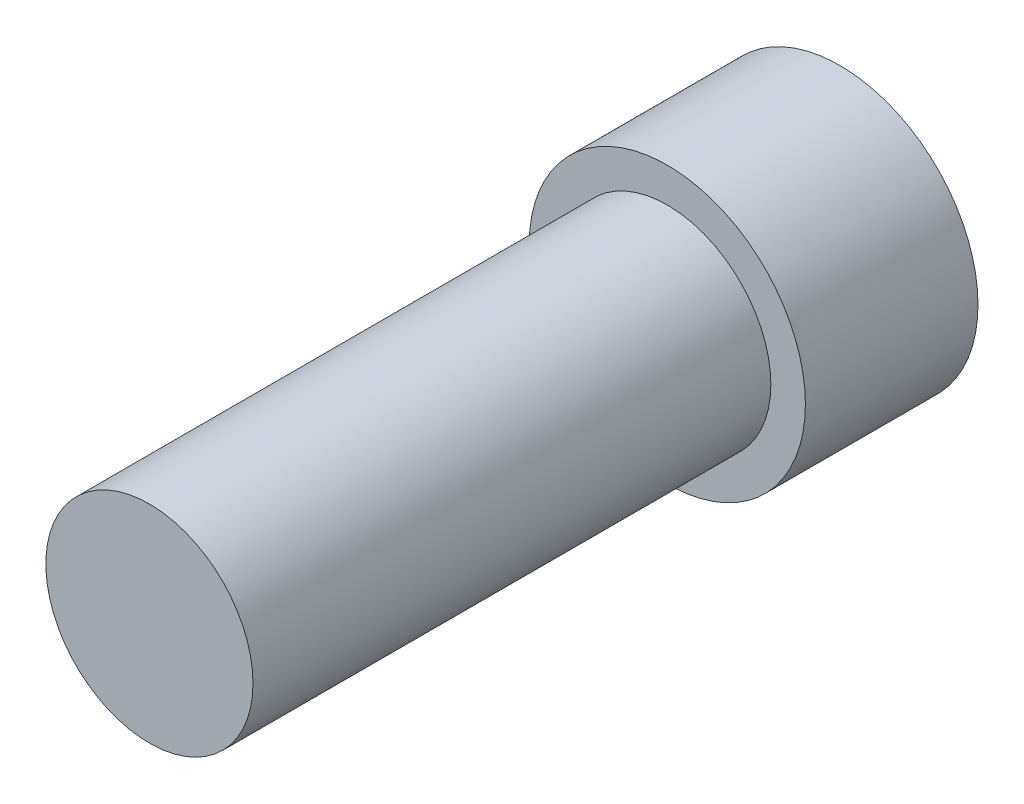
ISO-10303-21;
HEADER;
FILE_DESCRIPTION(('STEP AP214'),'2;1');
FILE_NAME('part.step','',(''),(''),'','','');
FILE_SCHEMA(('AUTOMOTIVE_DESIGN { 1 0 10303 214 1 1 1 1 }'));
ENDSEC;
DATA;
#1=APPLICATION_CONTEXT('core data for automotive mechanical design processes');
#2=APPLICATION_PROTOCOL_DEFINITION('international standard','automotive_design',2000,#1);
#3=PRODUCT_CONTEXT('',#1,'mechanical');
#4=PRODUCT('Part','Part','',(#3));
#5=PRODUCT_RELATED_PRODUCT_CATEGORY('part','',(#4));
#6=PRODUCT_DEFINITION_FORMATION('','',#4);
#7=PRODUCT_DEFINITION_CONTEXT('part definition',#1,'design');
#8=PRODUCT_DEFINITION('design','',#6,#7);
#9=PRODUCT_DEFINITION_SHAPE('','',#8);
#10=(LENGTH_UNIT() NAMED_UNIT(*) SI_UNIT(.MILLI.,.METRE.));
#11=(NAMED_UNIT(*) PLANE_ANGLE_UNIT() SI_UNIT($,.RADIAN.));
#12=(NAMED_UNIT(*) SI_UNIT($,.STERADIAN.) SOLID_ANGLE_UNIT());
#13=UNCERTAINTY_MEASURE_WITH_UNIT(LENGTH_MEASURE(1.E-05),#10,'distance_accuracy_value','');
#14=(GEOMETRIC_REPRESENTATION_CONTEXT(3) GLOBAL_UNCERTAINTY_ASSIGNED_CONTEXT((#13)) GLOBAL_UNIT_ASSIGNED_CONTEXT((#10,
#11,#12)) REPRESENTATION_CONTEXT('',''));
#15=CARTESIAN_POINT('',(0.,0.,0.));
#16=DIRECTION('',(0.,0.,1.));
#17=DIRECTION('',(1.,0.,0.));
#18=AXIS2_PLACEMENT_3D('',#15,#16,#17);
#19=CARTESIAN_POINT('',(0.,0.,5.));
#20=DIRECTION('',(0.,0.,-1.));
#21=DIRECTION('',(-1.,0.,0.));
#22=AXIS2_PLACEMENT_3D('',#19,#20,#21);
#23=CYLINDRICAL_SURFACE('',#22,4.);
#24=CARTESIAN_POINT('',(0.,0.,5.));
#25=DIRECTION('',(0.,0.,1.));
#26=DIRECTION('',(1.,0.,0.));
#27=AXIS2_PLACEMENT_3D('',#24,#25,#26);
#28=CIRCLE('',#27,4.);
#29=CARTESIAN_POINT('',(4.,0.,5.));
#30=VERTEX_POINT('',#29);
#31=EDGE_CURVE('E49',#30,#30,#28,.T.);
#32=ORIENTED_EDGE('',*,*,#31,.F.);
#33=EDGE_LOOP('',(#32));
#34=FACE_BOUND('',#33,.T.);
#35=CARTESIAN_POINT('',(0.,0.,0.));
#36=DIRECTION('',(0.,0.,1.));
#37=DIRECTION('',(1.,0.,0.));
#38=AXIS2_PLACEMENT_3D('',#35,#36,#37);
#39=CIRCLE('',#38,4.);
#40=CARTESIAN_POINT('',(4.,0.,0.));
#41=VERTEX_POINT('',#40);
#42=EDGE_CURVE('E43',#41,#41,#39,.T.);
#43=ORIENTED_EDGE('',*,*,#42,.T.);
#44=EDGE_LOOP('',(#43));
#45=FACE_BOUND('',#44,.T.);
#46=ADVANCED_FACE('F40',(#34,#45),#23,.T.);
#47=CARTESIAN_POINT('',(0.,0.,5.));
#48=DIRECTION('',(0.,0.,1.));
#49=DIRECTION('',(1.,0.,0.));
#50=AXIS2_PLACEMENT_3D('',#47,#48,#49);
#51=PLANE('',#50);
#52=CARTESIAN_POINT('',(0.,0.,5.));
#53=DIRECTION('',(0.,0.,1.));
#54=DIRECTION('',(1.,0.,0.));
#55=AXIS2_PLACEMENT_3D('',#52,#53,#54);
#56=CIRCLE('',#55,3.);
#57=CARTESIAN_POINT('',(3.,0.,5.));
#58=VERTEX_POINT('',#57);
#59=EDGE_CURVE('E11',#58,#58,#56,.T.);
#60=ORIENTED_EDGE('',*,*,#59,.F.);
#61=EDGE_LOOP('',(#60));
#62=FACE_BOUND('',#61,.T.);
#63=ORIENTED_EDGE('',*,*,#31,.T.);
#64=EDGE_LOOP('',(#63));
#65=FACE_BOUND('',#64,.T.);
#66=ADVANCED_FACE('F180',(#62,#65),#51,.T.);
#67=CARTESIAN_POINT('',(0.,0.,0.));
#68=DIRECTION('',(0.,0.,1.));
#69=DIRECTION('',(1.,0.,0.));
#70=AXIS2_PLACEMENT_3D('',#67,#68,#69);
#71=PLANE('',#70);
#72=DIRECTION('',(-0.808522392035072,0.58846541238877,0.));
#73=VECTOR('',#72,1.);
#74=CARTESIAN_POINT('',(-0.294791557784919,-2.78224454496012,0.));
#75=LINE('',#74,#73);
#76=CARTESIAN_POINT('',(-0.294791557784919,-2.78224454496012,0.));
#77=VERTEX_POINT('',#76);
#78=CARTESIAN_POINT('',(-2.5568902343686,-1.13582529461713,0.));
#79=VERTEX_POINT('',#78);
#80=EDGE_CURVE('E138',#77,#79,#75,.T.);
#81=ORIENTED_EDGE('',*,*,#80,.F.);
#82=DIRECTION('',(-0.913887192394696,-0.405968224836549,0.));
#83=VECTOR('',#82,1.);
#84=CARTESIAN_POINT('',(2.26209867658368,-1.64641925034299,0.));
#85=LINE('',#84,#83);
#86=CARTESIAN_POINT('',(2.26209867658368,-1.64641925034299,0.));
#87=VERTEX_POINT('',#86);
#88=EDGE_CURVE('E57',#87,#77,#85,.T.);
#89=ORIENTED_EDGE('',*,*,#88,.F.);
#90=DIRECTION('',(-0.105364800359624,-0.994433637225319,0.));
#91=VECTOR('',#90,1.);
#92=CARTESIAN_POINT('',(2.5568902343686,1.13582529461713,0.));
#93=LINE('',#92,#91);
#94=CARTESIAN_POINT('',(2.5568902343686,1.13582529461713,0.));
#95=VERTEX_POINT('',#94);
#96=EDGE_CURVE('E151',#95,#87,#93,.T.);
#97=ORIENTED_EDGE('',*,*,#96,.F.);
#98=DIRECTION('',(0.808522392035073,-0.588465412388769,0.));
#99=VECTOR('',#98,1.);
#100=CARTESIAN_POINT('',(0.29479155778492,2.78224454496012,0.));
#101=LINE('',#100,#99);
#102=CARTESIAN_POINT('',(0.29479155778492,2.78224454496012,0.));
#103=VERTEX_POINT('',#102);
#104=EDGE_CURVE('E148',#103,#95,#101,.T.);
#105=ORIENTED_EDGE('',*,*,#104,.F.);
#106=DIRECTION('',(0.913887192394696,0.405968224836549,0.));
#107=VECTOR('',#106,1.);
#108=CARTESIAN_POINT('',(-2.26209867658368,1.64641925034299,0.));
#109=LINE('',#108,#107);
#110=CARTESIAN_POINT('',(-2.26209867658368,1.64641925034299,0.));
#111=VERTEX_POINT('',#110);
#112=EDGE_CURVE('E105',#111,#103,#109,.T.);
#113=ORIENTED_EDGE('',*,*,#112,.F.);
#114=DIRECTION('',(0.105364800359624,0.994433637225319,0.));
#115=VECTOR('',#114,1.);
#116=CARTESIAN_POINT('',(-2.5568902343686,-1.13582529461713,0.));
#117=LINE('',#116,#115);
#118=EDGE_CURVE('E142',#79,#111,#117,.T.);
#119=ORIENTED_EDGE('',*,*,#118,.F.);
#120=EDGE_LOOP('',(#81,#89,#97,#105,#113,#119));
#121=FACE_BOUND('',#120,.T.);
#122=ORIENTED_EDGE('',*,*,#42,.F.);
#123=EDGE_LOOP('',(#122));
#124=FACE_BOUND('',#123,.T.);
#125=ADVANCED_FACE('F177',(#121,#124),#71,.F.);
#126=CARTESIAN_POINT('',(0.,0.,20.));
#127=DIRECTION('',(0.,0.,-1.));
#128=DIRECTION('',(-1.,0.,0.));
#129=AXIS2_PLACEMENT_3D('',#126,#127,#128);
#130=CYLINDRICAL_SURFACE('',#129,3.);
#131=CARTESIAN_POINT('',(0.,0.,20.));
#132=DIRECTION('',(0.,0.,1.));
#133=DIRECTION('',(1.,0.,0.));
#134=AXIS2_PLACEMENT_3D('',#131,#132,#133);
#135=CIRCLE('',#134,3.);
#136=CARTESIAN_POINT('',(3.,0.,20.));
#137=VERTEX_POINT('',#136);
#138=EDGE_CURVE('E156',#137,#137,#135,.T.);
#139=ORIENTED_EDGE('',*,*,#138,.F.);
#140=EDGE_LOOP('',(#139));
#141=FACE_BOUND('',#140,.T.);
#142=ORIENTED_EDGE('',*,*,#59,.T.);
#143=EDGE_LOOP('',(#142));
#144=FACE_BOUND('',#143,.T.);
#145=ADVANCED_FACE('F179',(#141,#144),#130,.T.);
#146=CARTESIAN_POINT('',(0.,0.,20.));
#147=DIRECTION('',(0.,0.,1.));
#148=DIRECTION('',(1.,0.,0.));
#149=AXIS2_PLACEMENT_3D('',#146,#147,#148);
#150=PLANE('',#149);
#151=ORIENTED_EDGE('',*,*,#138,.T.);
#152=EDGE_LOOP('',(#151));
#153=FACE_BOUND('',#152,.T.);
#154=ADVANCED_FACE('F186',(#153),#150,.T.);
#155=CARTESIAN_POINT('',(2.26209867658368,-1.64641925034299,3.));
#156=DIRECTION('',(0.405968224836549,-0.913887192394696,0.));
#157=DIRECTION('',(0.913887192394697,0.405968224836549,0.));
#158=AXIS2_PLACEMENT_3D('',#155,#156,#157);
#159=PLANE('',#158);
#160=ORIENTED_EDGE('',*,*,#88,.T.);
#161=DIRECTION('',(0.,0.,-1.));
#162=VECTOR('',#161,1.);
#163=CARTESIAN_POINT('',(-0.294791557784919,-2.78224454496012,3.));
#164=LINE('',#163,#162);
#165=CARTESIAN_POINT('',(-0.294791557784919,-2.78224454496012,3.));
#166=VERTEX_POINT('',#165);
#167=EDGE_CURVE('E87',#166,#77,#164,.T.);
#168=ORIENTED_EDGE('',*,*,#167,.F.);
#169=DIRECTION('',(-0.913887192394696,-0.405968224836549,0.));
#170=VECTOR('',#169,1.);
#171=CARTESIAN_POINT('',(2.26209867658368,-1.64641925034299,3.));
#172=LINE('',#171,#170);
#173=CARTESIAN_POINT('',(2.26209867658368,-1.64641925034299,3.));
#174=VERTEX_POINT('',#173);
#175=EDGE_CURVE('E154',#174,#166,#172,.T.);
#176=ORIENTED_EDGE('',*,*,#175,.F.);
#177=DIRECTION('',(0.,0.,-1.));
#178=VECTOR('',#177,1.);
#179=CARTESIAN_POINT('',(2.26209867658368,-1.64641925034299,3.));
#180=LINE('',#179,#178);
#181=EDGE_CURVE('E65',#174,#87,#180,.T.);
#182=ORIENTED_EDGE('',*,*,#181,.T.);
#183=EDGE_LOOP('',(#160,#168,#176,#182));
#184=FACE_BOUND('',#183,.T.);
#185=ADVANCED_FACE('F215',(#184),#159,.F.);
#186=CARTESIAN_POINT('',(2.5568902343686,1.13582529461713,3.));
#187=DIRECTION('',(0.994433637225319,-0.105364800359624,0.));
#188=DIRECTION('',(0.105364800359624,0.994433637225319,0.));
#189=AXIS2_PLACEMENT_3D('',#186,#187,#188);
#190=PLANE('',#189);
#191=ORIENTED_EDGE('',*,*,#96,.T.);
#192=ORIENTED_EDGE('',*,*,#181,.F.);
#193=DIRECTION('',(-0.105364800359624,-0.994433637225319,0.));
#194=VECTOR('',#193,1.);
#195=CARTESIAN_POINT('',(2.5568902343686,1.13582529461713,3.));
#196=LINE('',#195,#194);
#197=CARTESIAN_POINT('',(2.5568902343686,1.13582529461713,3.));
#198=VERTEX_POINT('',#197);
#199=EDGE_CURVE('E119',#198,#174,#196,.T.);
#200=ORIENTED_EDGE('',*,*,#199,.F.);
#201=DIRECTION('',(0.,0.,-1.));
#202=VECTOR('',#201,1.);
#203=CARTESIAN_POINT('',(2.5568902343686,1.13582529461713,3.));
#204=LINE('',#203,#202);
#205=EDGE_CURVE('E110',#198,#95,#204,.T.);
#206=ORIENTED_EDGE('',*,*,#205,.T.);
#207=EDGE_LOOP('',(#191,#192,#200,#206));
#208=FACE_BOUND('',#207,.T.);
#209=ADVANCED_FACE('F223',(#208),#190,.F.);
#210=CARTESIAN_POINT('',(0.29479155778492,2.78224454496012,3.));
#211=DIRECTION('',(0.588465412388769,0.808522392035073,0.));
#212=DIRECTION('',(-0.808522392035073,0.588465412388769,0.));
#213=AXIS2_PLACEMENT_3D('',#210,#211,#212);
#214=PLANE('',#213);
#215=ORIENTED_EDGE('',*,*,#104,.T.);
#216=ORIENTED_EDGE('',*,*,#205,.F.);
#217=DIRECTION('',(0.808522392035073,-0.588465412388769,0.));
#218=VECTOR('',#217,1.);
#219=CARTESIAN_POINT('',(0.29479155778492,2.78224454496012,3.));
#220=LINE('',#219,#218);
#221=CARTESIAN_POINT('',(0.29479155778492,2.78224454496012,3.));
#222=VERTEX_POINT('',#221);
#223=EDGE_CURVE('E114',#222,#198,#220,.T.);
#224=ORIENTED_EDGE('',*,*,#223,.F.);
#225=DIRECTION('',(0.,0.,-1.));
#226=VECTOR('',#225,1.);
#227=CARTESIAN_POINT('',(0.29479155778492,2.78224454496012,3.));
#228=LINE('',#227,#226);
#229=EDGE_CURVE('E98',#222,#103,#228,.T.);
#230=ORIENTED_EDGE('',*,*,#229,.T.);
#231=EDGE_LOOP('',(#215,#216,#224,#230));
#232=FACE_BOUND('',#231,.T.);
#233=ADVANCED_FACE('F115',(#232),#214,.F.);
#234=CARTESIAN_POINT('',(-2.26209867658368,1.64641925034299,3.));
#235=DIRECTION('',(-0.405968224836549,0.913887192394696,0.));
#236=DIRECTION('',(-0.913887192394697,-0.405968224836549,0.));
#237=AXIS2_PLACEMENT_3D('',#234,#235,#236);
#238=PLANE('',#237);
#239=ORIENTED_EDGE('',*,*,#112,.T.);
#240=ORIENTED_EDGE('',*,*,#229,.F.);
#241=DIRECTION('',(0.913887192394696,0.405968224836549,0.));
#242=VECTOR('',#241,1.);
#243=CARTESIAN_POINT('',(-2.26209867658368,1.64641925034299,3.));
#244=LINE('',#243,#242);
#245=CARTESIAN_POINT('',(-2.26209867658368,1.64641925034299,3.));
#246=VERTEX_POINT('',#245);
#247=EDGE_CURVE('E102',#246,#222,#244,.T.);
#248=ORIENTED_EDGE('',*,*,#247,.F.);
#249=DIRECTION('',(0.,0.,-1.));
#250=VECTOR('',#249,1.);
#251=CARTESIAN_POINT('',(-2.26209867658368,1.64641925034299,3.));
#252=LINE('',#251,#250);
#253=EDGE_CURVE('E111',#246,#111,#252,.T.);
#254=ORIENTED_EDGE('',*,*,#253,.T.);
#255=EDGE_LOOP('',(#239,#240,#248,#254));
#256=FACE_BOUND('',#255,.T.);
#257=ADVANCED_FACE('F100',(#256),#238,.F.);
#258=CARTESIAN_POINT('',(-2.5568902343686,-1.13582529461713,3.));
#259=DIRECTION('',(-0.994433637225319,0.105364800359624,0.));
#260=DIRECTION('',(-0.105364800359624,-0.994433637225319,0.));
#261=AXIS2_PLACEMENT_3D('',#258,#259,#260);
#262=PLANE('',#261);
#263=ORIENTED_EDGE('',*,*,#118,.T.);
#264=ORIENTED_EDGE('',*,*,#253,.F.);
#265=DIRECTION('',(0.105364800359624,0.994433637225319,0.));
#266=VECTOR('',#265,1.);
#267=CARTESIAN_POINT('',(-2.5568902343686,-1.13582529461713,3.));
#268=LINE('',#267,#266);
#269=CARTESIAN_POINT('',(-2.5568902343686,-1.13582529461713,3.));
#270=VERTEX_POINT('',#269);
#271=EDGE_CURVE('E125',#270,#246,#268,.T.);
#272=ORIENTED_EDGE('',*,*,#271,.F.);
#273=DIRECTION('',(0.,0.,-1.));
#274=VECTOR('',#273,1.);
#275=CARTESIAN_POINT('',(-2.5568902343686,-1.13582529461713,3.));
#276=LINE('',#275,#274);
#277=EDGE_CURVE('E161',#270,#79,#276,.T.);
#278=ORIENTED_EDGE('',*,*,#277,.T.);
#279=EDGE_LOOP('',(#263,#264,#272,#278));
#280=FACE_BOUND('',#279,.T.);
#281=ADVANCED_FACE('F245',(#280),#262,.F.);
#282=CARTESIAN_POINT('',(-0.294791557784919,-2.78224454496012,3.));
#283=DIRECTION('',(-0.58846541238877,-0.808522392035072,0.));
#284=DIRECTION('',(0.808522392035072,-0.58846541238877,0.));
#285=AXIS2_PLACEMENT_3D('',#282,#283,#284);
#286=PLANE('',#285);
#287=ORIENTED_EDGE('',*,*,#80,.T.);
#288=ORIENTED_EDGE('',*,*,#277,.F.);
#289=DIRECTION('',(-0.808522392035072,0.58846541238877,0.));
#290=VECTOR('',#289,1.);
#291=CARTESIAN_POINT('',(-0.294791557784919,-2.78224454496012,3.));
#292=LINE('',#291,#290);
#293=EDGE_CURVE('E130',#166,#270,#292,.T.);
#294=ORIENTED_EDGE('',*,*,#293,.F.);
#295=ORIENTED_EDGE('',*,*,#167,.T.);
#296=EDGE_LOOP('',(#287,#288,#294,#295));
#297=FACE_BOUND('',#296,.T.);
#298=ADVANCED_FACE('F253',(#297),#286,.F.);
#299=CARTESIAN_POINT('',(0.,0.,3.));
#300=DIRECTION('',(0.,0.,-1.));
#301=DIRECTION('',(-1.,0.,0.));
#302=AXIS2_PLACEMENT_3D('',#299,#300,#301);
#303=PLANE('',#302);
#304=ORIENTED_EDGE('',*,*,#175,.T.);
#305=ORIENTED_EDGE('',*,*,#293,.T.);
#306=ORIENTED_EDGE('',*,*,#271,.T.);
#307=ORIENTED_EDGE('',*,*,#247,.T.);
#308=ORIENTED_EDGE('',*,*,#223,.T.);
#309=ORIENTED_EDGE('',*,*,#199,.T.);
#310=EDGE_LOOP('',(#304,#305,#306,#307,#308,#309));
#311=FACE_BOUND('',#310,.T.);
#312=ADVANCED_FACE('F122',(#311),#303,.T.);
#313=CLOSED_SHELL('',(#46,#66,#125,#145,#154,#185,#209,#233,#257,#281,#298,#312));
#314=MANIFOLD_SOLID_BREP('B2',#313);
#315=ADVANCED_BREP_SHAPE_REPRESENTATION('',(#18,#314),#14);
#316=SHAPE_DEFINITION_REPRESENTATION(#9,#315);
ENDSEC;
END-ISO-10303-21;
